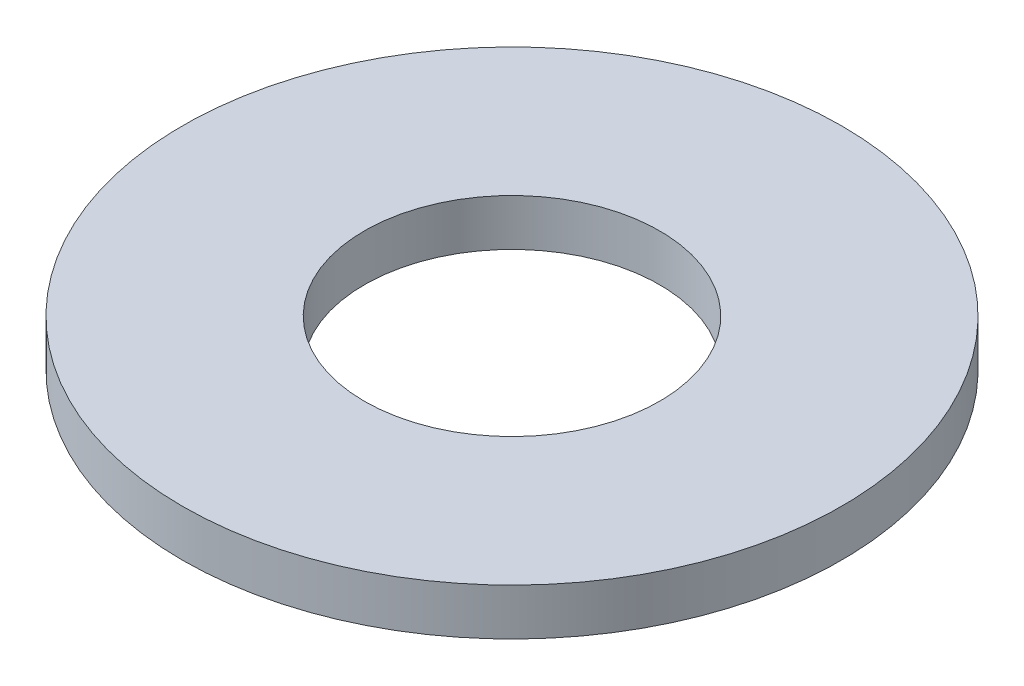
ISO-10303-21;
HEADER;
FILE_DESCRIPTION(('STEP AP214'),'2;1');
FILE_NAME('part.step','',(''),(''),'','','');
FILE_SCHEMA(('AUTOMOTIVE_DESIGN { 1 0 10303 214 1 1 1 1 }'));
ENDSEC;
DATA;
#1=APPLICATION_CONTEXT('core data for automotive mechanical design processes');
#2=APPLICATION_PROTOCOL_DEFINITION('international standard','automotive_design',2000,#1);
#3=PRODUCT_CONTEXT('',#1,'mechanical');
#4=PRODUCT('Part','Part','',(#3));
#5=PRODUCT_RELATED_PRODUCT_CATEGORY('part','',(#4));
#6=PRODUCT_DEFINITION_FORMATION('','',#4);
#7=PRODUCT_DEFINITION_CONTEXT('part definition',#1,'design');
#8=PRODUCT_DEFINITION('design','',#6,#7);
#9=PRODUCT_DEFINITION_SHAPE('','',#8);
#10=(LENGTH_UNIT() NAMED_UNIT(*) SI_UNIT(.MILLI.,.METRE.));
#11=(NAMED_UNIT(*) PLANE_ANGLE_UNIT() SI_UNIT($,.RADIAN.));
#12=(NAMED_UNIT(*) SI_UNIT($,.STERADIAN.) SOLID_ANGLE_UNIT());
#13=UNCERTAINTY_MEASURE_WITH_UNIT(LENGTH_MEASURE(1.E-05),#10,'distance_accuracy_value','');
#14=(GEOMETRIC_REPRESENTATION_CONTEXT(3) GLOBAL_UNCERTAINTY_ASSIGNED_CONTEXT((#13)) GLOBAL_UNIT_ASSIGNED_CONTEXT((#10,
#11,#12)) REPRESENTATION_CONTEXT('',''));
#15=CARTESIAN_POINT('',(0.,0.,0.));
#16=DIRECTION('',(0.,0.,1.));
#17=DIRECTION('',(1.,0.,0.));
#18=AXIS2_PLACEMENT_3D('',#15,#16,#17);
#19=CARTESIAN_POINT('',(0.,1.5748,0.));
#20=DIRECTION('',(0.,1.,0.));
#21=DIRECTION('',(0.,0.,1.));
#22=AXIS2_PLACEMENT_3D('',#19,#20,#21);
#23=PLANE('',#22);
#24=CARTESIAN_POINT('',(0.,1.5748,0.));
#25=DIRECTION('',(0.,1.,0.));
#26=DIRECTION('',(0.,0.,1.));
#27=AXIS2_PLACEMENT_3D('',#24,#25,#26);
#28=CIRCLE('',#27,11.1125);
#29=CARTESIAN_POINT('',(0.,1.5748,11.1125));
#30=VERTEX_POINT('',#29);
#31=EDGE_CURVE('E10',#30,#30,#28,.T.);
#32=ORIENTED_EDGE('',*,*,#31,.T.);
#33=EDGE_LOOP('',(#32));
#34=FACE_BOUND('',#33,.T.);
#35=CARTESIAN_POINT('',(0.,1.5748,0.));
#36=DIRECTION('',(0.,1.,0.));
#37=DIRECTION('',(0.,0.,1.));
#38=AXIS2_PLACEMENT_3D('',#35,#36,#37);
#39=CIRCLE('',#38,4.9784);
#40=CARTESIAN_POINT('',(0.,1.5748,4.9784));
#41=VERTEX_POINT('',#40);
#42=EDGE_CURVE('E41',#41,#41,#39,.T.);
#43=ORIENTED_EDGE('',*,*,#42,.F.);
#44=EDGE_LOOP('',(#43));
#45=FACE_BOUND('',#44,.T.);
#46=ADVANCED_FACE('F30',(#34,#45),#23,.T.);
#47=CARTESIAN_POINT('',(0.,0.,0.));
#48=DIRECTION('',(0.,1.,0.));
#49=DIRECTION('',(0.,0.,1.));
#50=AXIS2_PLACEMENT_3D('',#47,#48,#49);
#51=PLANE('',#50);
#52=CARTESIAN_POINT('',(0.,0.,0.));
#53=DIRECTION('',(0.,1.,0.));
#54=DIRECTION('',(0.,0.,1.));
#55=AXIS2_PLACEMENT_3D('',#52,#53,#54);
#56=CIRCLE('',#55,11.1125);
#57=CARTESIAN_POINT('',(0.,0.,11.1125));
#58=VERTEX_POINT('',#57);
#59=EDGE_CURVE('E34',#58,#58,#56,.T.);
#60=ORIENTED_EDGE('',*,*,#59,.F.);
#61=EDGE_LOOP('',(#60));
#62=FACE_BOUND('',#61,.T.);
#63=CARTESIAN_POINT('',(0.,0.,0.));
#64=DIRECTION('',(0.,1.,0.));
#65=DIRECTION('',(0.,0.,1.));
#66=AXIS2_PLACEMENT_3D('',#63,#64,#65);
#67=CIRCLE('',#66,4.9784);
#68=CARTESIAN_POINT('',(0.,0.,4.9784));
#69=VERTEX_POINT('',#68);
#70=EDGE_CURVE('E43',#69,#69,#67,.T.);
#71=ORIENTED_EDGE('',*,*,#70,.T.);
#72=EDGE_LOOP('',(#71));
#73=FACE_BOUND('',#72,.T.);
#74=ADVANCED_FACE('F53',(#62,#73),#51,.F.);
#75=CARTESIAN_POINT('',(0.,1.5748,0.));
#76=DIRECTION('',(0.,-1.,0.));
#77=DIRECTION('',(0.,0.,-1.));
#78=AXIS2_PLACEMENT_3D('',#75,#76,#77);
#79=CYLINDRICAL_SURFACE('',#78,11.1125);
#80=ORIENTED_EDGE('',*,*,#31,.F.);
#81=EDGE_LOOP('',(#80));
#82=FACE_BOUND('',#81,.T.);
#83=ORIENTED_EDGE('',*,*,#59,.T.);
#84=EDGE_LOOP('',(#83));
#85=FACE_BOUND('',#84,.T.);
#86=ADVANCED_FACE('F32',(#82,#85),#79,.T.);
#87=CARTESIAN_POINT('',(0.,1.5748,0.));
#88=DIRECTION('',(0.,-1.,0.));
#89=DIRECTION('',(0.,0.,-1.));
#90=AXIS2_PLACEMENT_3D('',#87,#88,#89);
#91=CYLINDRICAL_SURFACE('',#90,4.9784);
#92=ORIENTED_EDGE('',*,*,#42,.T.);
#93=EDGE_LOOP('',(#92));
#94=FACE_BOUND('',#93,.T.);
#95=ORIENTED_EDGE('',*,*,#70,.F.);
#96=EDGE_LOOP('',(#95));
#97=FACE_BOUND('',#96,.T.);
#98=ADVANCED_FACE('F49',(#94,#97),#91,.F.);
#99=CLOSED_SHELL('',(#46,#74,#86,#98));
#100=MANIFOLD_SOLID_BREP('B2',#99);
#101=ADVANCED_BREP_SHAPE_REPRESENTATION('',(#18,#100),#14);
#102=SHAPE_DEFINITION_REPRESENTATION(#9,#101);
ENDSEC;
END-ISO-10303-21;
